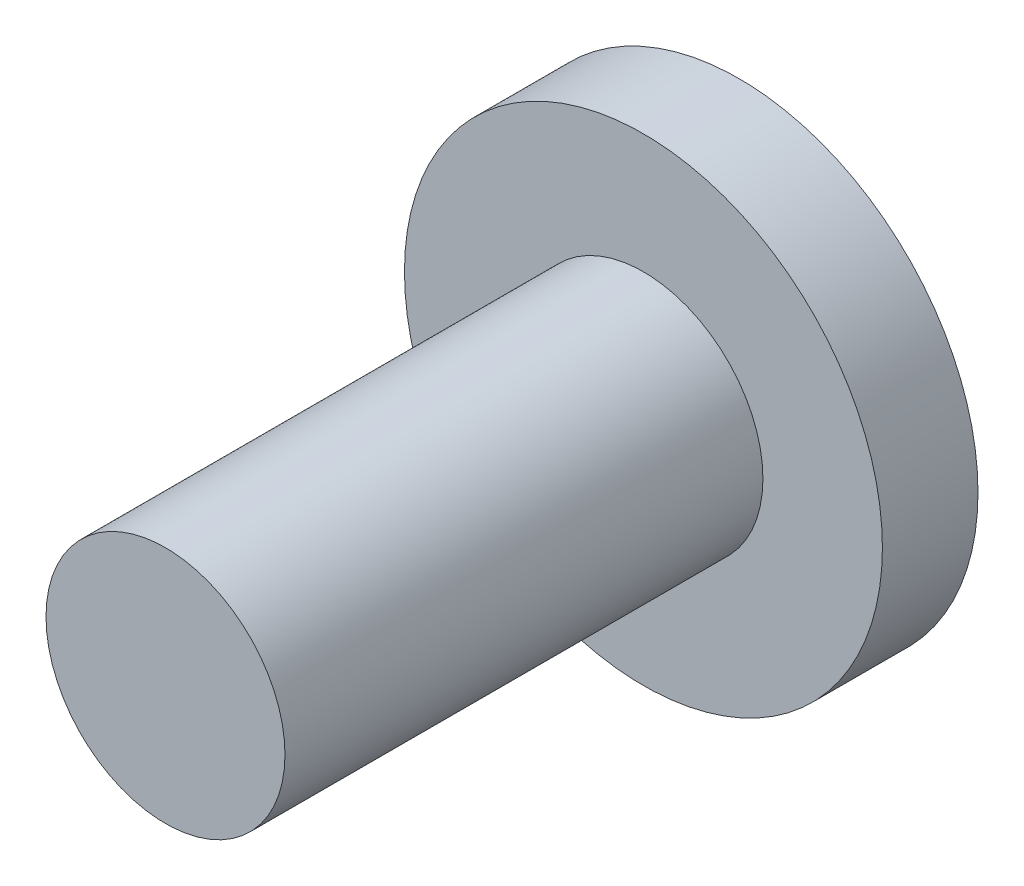
ISO-10303-21;
HEADER;
FILE_DESCRIPTION(('STEP AP214'),'2;1');
FILE_NAME('part.step','',(''),(''),'','','');
FILE_SCHEMA(('AUTOMOTIVE_DESIGN { 1 0 10303 214 1 1 1 1 }'));
ENDSEC;
DATA;
#1=APPLICATION_CONTEXT('core data for automotive mechanical design processes');
#2=APPLICATION_PROTOCOL_DEFINITION('international standard','automotive_design',2000,#1);
#3=PRODUCT_CONTEXT('',#1,'mechanical');
#4=PRODUCT('Part','Part','',(#3));
#5=PRODUCT_RELATED_PRODUCT_CATEGORY('part','',(#4));
#6=PRODUCT_DEFINITION_FORMATION('','',#4);
#7=PRODUCT_DEFINITION_CONTEXT('part definition',#1,'design');
#8=PRODUCT_DEFINITION('design','',#6,#7);
#9=PRODUCT_DEFINITION_SHAPE('','',#8);
#10=(LENGTH_UNIT() NAMED_UNIT(*) SI_UNIT(.MILLI.,.METRE.));
#11=(NAMED_UNIT(*) PLANE_ANGLE_UNIT() SI_UNIT($,.RADIAN.));
#12=(NAMED_UNIT(*) SI_UNIT($,.STERADIAN.) SOLID_ANGLE_UNIT());
#13=UNCERTAINTY_MEASURE_WITH_UNIT(LENGTH_MEASURE(1.E-05),#10,'distance_accuracy_value','');
#14=(GEOMETRIC_REPRESENTATION_CONTEXT(3) GLOBAL_UNCERTAINTY_ASSIGNED_CONTEXT((#13)) GLOBAL_UNIT_ASSIGNED_CONTEXT((#10,
#11,#12)) REPRESENTATION_CONTEXT('',''));
#15=CARTESIAN_POINT('',(0.,0.,0.));
#16=DIRECTION('',(0.,0.,1.));
#17=DIRECTION('',(1.,0.,0.));
#18=AXIS2_PLACEMENT_3D('',#15,#16,#17);
#19=CARTESIAN_POINT('',(0.,0.,0.8));
#20=DIRECTION('',(0.,0.,1.));
#21=DIRECTION('',(1.,0.,0.));
#22=AXIS2_PLACEMENT_3D('',#19,#20,#21);
#23=PLANE('',#22);
#24=CARTESIAN_POINT('',(0.,0.,0.8));
#25=DIRECTION('',(0.,0.,1.));
#26=DIRECTION('',(1.,0.,0.));
#27=AXIS2_PLACEMENT_3D('',#24,#25,#26);
#28=CIRCLE('',#27,2.);
#29=CARTESIAN_POINT('',(2.,0.,0.8));
#30=VERTEX_POINT('',#29);
#31=EDGE_CURVE('E10',#30,#30,#28,.T.);
#32=ORIENTED_EDGE('',*,*,#31,.T.);
#33=EDGE_LOOP('',(#32));
#34=FACE_BOUND('',#33,.T.);
#35=CARTESIAN_POINT('',(0.,0.,0.8));
#36=DIRECTION('',(0.,0.,1.));
#37=DIRECTION('',(1.,0.,0.));
#38=AXIS2_PLACEMENT_3D('',#35,#36,#37);
#39=CIRCLE('',#38,1.);
#40=CARTESIAN_POINT('',(1.,0.,0.8));
#41=VERTEX_POINT('',#40);
#42=EDGE_CURVE('E45',#41,#41,#39,.T.);
#43=ORIENTED_EDGE('',*,*,#42,.F.);
#44=EDGE_LOOP('',(#43));
#45=FACE_BOUND('',#44,.T.);
#46=ADVANCED_FACE('F32',(#34,#45),#23,.T.);
#47=CARTESIAN_POINT('',(0.,0.,0.8));
#48=DIRECTION('',(0.,0.,-1.));
#49=DIRECTION('',(-1.,0.,0.));
#50=AXIS2_PLACEMENT_3D('',#47,#48,#49);
#51=CYLINDRICAL_SURFACE('',#50,2.);
#52=ORIENTED_EDGE('',*,*,#31,.F.);
#53=EDGE_LOOP('',(#52));
#54=FACE_BOUND('',#53,.T.);
#55=CARTESIAN_POINT('',(0.,0.,0.));
#56=DIRECTION('',(0.,0.,1.));
#57=DIRECTION('',(1.,0.,0.));
#58=AXIS2_PLACEMENT_3D('',#55,#56,#57);
#59=CIRCLE('',#58,2.);
#60=CARTESIAN_POINT('',(2.,0.,0.));
#61=VERTEX_POINT('',#60);
#62=EDGE_CURVE('E36',#61,#61,#59,.T.);
#63=ORIENTED_EDGE('',*,*,#62,.T.);
#64=EDGE_LOOP('',(#63));
#65=FACE_BOUND('',#64,.T.);
#66=ADVANCED_FACE('F34',(#54,#65),#51,.T.);
#67=CARTESIAN_POINT('',(0.,0.,0.));
#68=DIRECTION('',(0.,0.,1.));
#69=DIRECTION('',(1.,0.,0.));
#70=AXIS2_PLACEMENT_3D('',#67,#68,#69);
#71=PLANE('',#70);
#72=ORIENTED_EDGE('',*,*,#62,.F.);
#73=EDGE_LOOP('',(#72));
#74=FACE_BOUND('',#73,.T.);
#75=ADVANCED_FACE('F56',(#74),#71,.F.);
#76=CARTESIAN_POINT('',(0.,0.,4.8));
#77=DIRECTION('',(0.,0.,-1.));
#78=DIRECTION('',(-1.,0.,0.));
#79=AXIS2_PLACEMENT_3D('',#76,#77,#78);
#80=CYLINDRICAL_SURFACE('',#79,1.);
#81=CARTESIAN_POINT('',(0.,0.,4.8));
#82=DIRECTION('',(0.,0.,1.));
#83=DIRECTION('',(1.,0.,0.));
#84=AXIS2_PLACEMENT_3D('',#81,#82,#83);
#85=CIRCLE('',#84,1.);
#86=CARTESIAN_POINT('',(1.,0.,4.8));
#87=VERTEX_POINT('',#86);
#88=EDGE_CURVE('E43',#87,#87,#85,.T.);
#89=ORIENTED_EDGE('',*,*,#88,.F.);
#90=EDGE_LOOP('',(#89));
#91=FACE_BOUND('',#90,.T.);
#92=ORIENTED_EDGE('',*,*,#42,.T.);
#93=EDGE_LOOP('',(#92));
#94=FACE_BOUND('',#93,.T.);
#95=ADVANCED_FACE('F53',(#91,#94),#80,.T.);
#96=CARTESIAN_POINT('',(0.,0.,4.8));
#97=DIRECTION('',(0.,0.,1.));
#98=DIRECTION('',(1.,0.,0.));
#99=AXIS2_PLACEMENT_3D('',#96,#97,#98);
#100=PLANE('',#99);
#101=ORIENTED_EDGE('',*,*,#88,.T.);
#102=EDGE_LOOP('',(#101));
#103=FACE_BOUND('',#102,.T.);
#104=ADVANCED_FACE('F51',(#103),#100,.T.);
#105=CLOSED_SHELL('',(#46,#66,#75,#95,#104));
#106=MANIFOLD_SOLID_BREP('B2',#105);
#107=ADVANCED_BREP_SHAPE_REPRESENTATION('',(#18,#106),#14);
#108=SHAPE_DEFINITION_REPRESENTATION(#9,#107);
ENDSEC;
END-ISO-10303-21;
